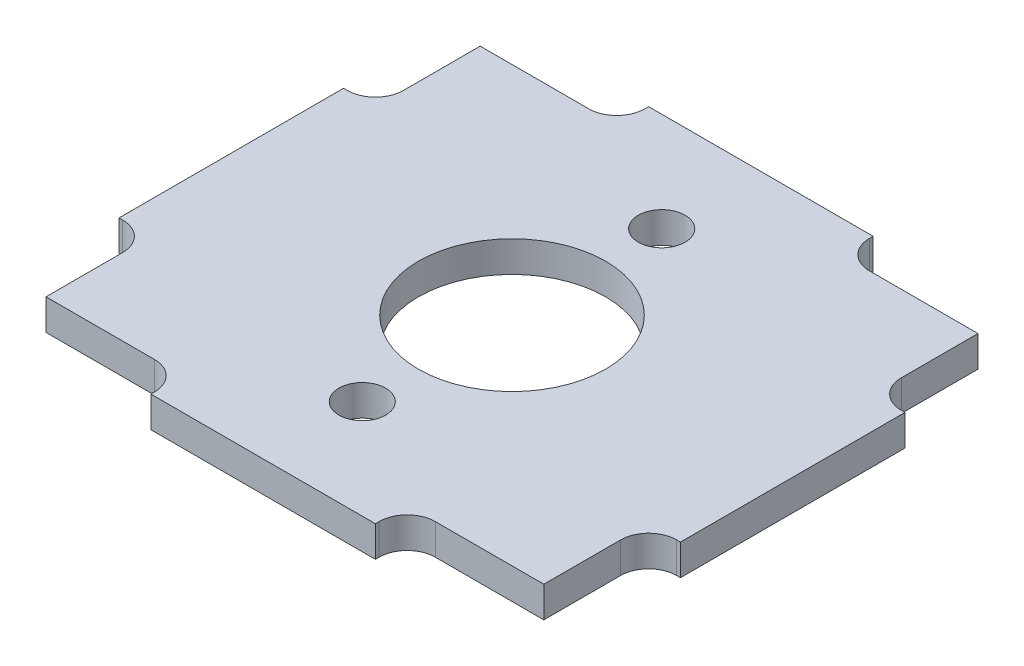
ISO-10303-21;
HEADER;
FILE_DESCRIPTION(('STEP AP214'),'2;1');
FILE_NAME('part.step','',(''),(''),'','','');
FILE_SCHEMA(('AUTOMOTIVE_DESIGN { 1 0 10303 214 1 1 1 1 }'));
ENDSEC;
DATA;
#1=APPLICATION_CONTEXT('core data for automotive mechanical design processes');
#2=APPLICATION_PROTOCOL_DEFINITION('international standard','automotive_design',2000,#1);
#3=PRODUCT_CONTEXT('',#1,'mechanical');
#4=PRODUCT('Part','Part','',(#3));
#5=PRODUCT_RELATED_PRODUCT_CATEGORY('part','',(#4));
#6=PRODUCT_DEFINITION_FORMATION('','',#4);
#7=PRODUCT_DEFINITION_CONTEXT('part definition',#1,'design');
#8=PRODUCT_DEFINITION('design','',#6,#7);
#9=PRODUCT_DEFINITION_SHAPE('','',#8);
#10=(LENGTH_UNIT() NAMED_UNIT(*) SI_UNIT(.MILLI.,.METRE.));
#11=(NAMED_UNIT(*) PLANE_ANGLE_UNIT() SI_UNIT($,.RADIAN.));
#12=(NAMED_UNIT(*) SI_UNIT($,.STERADIAN.) SOLID_ANGLE_UNIT());
#13=UNCERTAINTY_MEASURE_WITH_UNIT(LENGTH_MEASURE(1.E-05),#10,'distance_accuracy_value','');
#14=(GEOMETRIC_REPRESENTATION_CONTEXT(3) GLOBAL_UNCERTAINTY_ASSIGNED_CONTEXT((#13)) GLOBAL_UNIT_ASSIGNED_CONTEXT((#10,
#11,#12)) REPRESENTATION_CONTEXT('',''));
#15=CARTESIAN_POINT('',(0.,0.,0.));
#16=DIRECTION('',(0.,0.,1.));
#17=DIRECTION('',(1.,0.,0.));
#18=AXIS2_PLACEMENT_3D('',#15,#16,#17);
#19=CARTESIAN_POINT('',(-6.,-0.825,0.));
#20=DIRECTION('',(1.,0.,0.));
#21=DIRECTION('',(0.,0.,-1.));
#22=AXIS2_PLACEMENT_3D('',#19,#20,#21);
#23=PLANE('',#22);
#24=DIRECTION('',(0.,0.,-1.));
#25=VECTOR('',#24,1.);
#26=CARTESIAN_POINT('',(-6.,0.825,0.));
#27=LINE('',#26,#25);
#28=CARTESIAN_POINT('',(-6.,0.825,13.3));
#29=VERTEX_POINT('',#28);
#30=CARTESIAN_POINT('',(-6.,0.825,13.1));
#31=VERTEX_POINT('',#30);
#32=EDGE_CURVE('E298',#29,#31,#27,.T.);
#33=ORIENTED_EDGE('',*,*,#32,.T.);
#34=DIRECTION('',(0.,1.,0.));
#35=VECTOR('',#34,1.);
#36=CARTESIAN_POINT('',(-6.,-0.825,13.1));
#37=LINE('',#36,#35);
#38=CARTESIAN_POINT('',(-6.,-0.825,13.1));
#39=VERTEX_POINT('',#38);
#40=EDGE_CURVE('E236',#31,#39,#37,.F.);
#41=ORIENTED_EDGE('',*,*,#40,.T.);
#42=DIRECTION('',(0.,0.,-1.));
#43=VECTOR('',#42,1.);
#44=CARTESIAN_POINT('',(-6.,-0.825,0.));
#45=LINE('',#44,#43);
#46=CARTESIAN_POINT('',(-6.,-0.825,13.3));
#47=VERTEX_POINT('',#46);
#48=EDGE_CURVE('E234',#47,#39,#45,.T.);
#49=ORIENTED_EDGE('',*,*,#48,.F.);
#50=DIRECTION('',(0.,1.,0.));
#51=VECTOR('',#50,1.);
#52=CARTESIAN_POINT('',(-6.,-0.825,13.3));
#53=LINE('',#52,#51);
#54=EDGE_CURVE('E220',#47,#29,#53,.T.);
#55=ORIENTED_EDGE('',*,*,#54,.T.);
#56=EDGE_LOOP('',(#33,#41,#49,#55));
#57=FACE_BOUND('',#56,.T.);
#58=ADVANCED_FACE('F35',(#57),#23,.F.);
#59=CARTESIAN_POINT('',(0.,-0.825,11.6));
#60=DIRECTION('',(0.,0.,-1.));
#61=DIRECTION('',(-1.,0.,0.));
#62=AXIS2_PLACEMENT_3D('',#59,#60,#61);
#63=PLANE('',#62);
#64=DIRECTION('',(-1.,0.,0.));
#65=VECTOR('',#64,1.);
#66=CARTESIAN_POINT('',(0.,-0.825,11.6));
#67=LINE('',#66,#65);
#68=CARTESIAN_POINT('',(-7.5,-0.825,11.6));
#69=VERTEX_POINT('',#68);
#70=CARTESIAN_POINT('',(-13.3,-0.825,11.6));
#71=VERTEX_POINT('',#70);
#72=EDGE_CURVE('E231',#69,#71,#67,.T.);
#73=ORIENTED_EDGE('',*,*,#72,.F.);
#74=DIRECTION('',(0.,1.,0.));
#75=VECTOR('',#74,1.);
#76=CARTESIAN_POINT('',(-7.5,0.825,11.6));
#77=LINE('',#76,#75);
#78=CARTESIAN_POINT('',(-7.5,0.825,11.6));
#79=VERTEX_POINT('',#78);
#80=EDGE_CURVE('E381',#69,#79,#77,.T.);
#81=ORIENTED_EDGE('',*,*,#80,.T.);
#82=DIRECTION('',(-1.,0.,0.));
#83=VECTOR('',#82,1.);
#84=CARTESIAN_POINT('',(0.,0.825,11.6));
#85=LINE('',#84,#83);
#86=CARTESIAN_POINT('',(-13.3,0.825,11.6));
#87=VERTEX_POINT('',#86);
#88=EDGE_CURVE('E342',#79,#87,#85,.T.);
#89=ORIENTED_EDGE('',*,*,#88,.T.);
#90=DIRECTION('',(0.,1.,0.));
#91=VECTOR('',#90,1.);
#92=CARTESIAN_POINT('',(-13.3,-0.825,11.6));
#93=LINE('',#92,#91);
#94=EDGE_CURVE('E346',#71,#87,#93,.T.);
#95=ORIENTED_EDGE('',*,*,#94,.F.);
#96=EDGE_LOOP('',(#73,#81,#89,#95));
#97=FACE_BOUND('',#96,.T.);
#98=ADVANCED_FACE('F499',(#97),#63,.F.);
#99=CARTESIAN_POINT('',(-13.3,-0.825,0.));
#100=DIRECTION('',(-1.,0.,0.));
#101=DIRECTION('',(0.,0.,1.));
#102=AXIS2_PLACEMENT_3D('',#99,#100,#101);
#103=PLANE('',#102);
#104=DIRECTION('',(0.,0.,1.));
#105=VECTOR('',#104,1.);
#106=CARTESIAN_POINT('',(-13.3,0.825,0.));
#107=LINE('',#106,#105);
#108=CARTESIAN_POINT('',(-13.3,0.825,7.5));
#109=VERTEX_POINT('',#108);
#110=EDGE_CURVE('E340',#109,#87,#107,.T.);
#111=ORIENTED_EDGE('',*,*,#110,.F.);
#112=DIRECTION('',(0.,1.,0.));
#113=VECTOR('',#112,1.);
#114=CARTESIAN_POINT('',(-13.3,-0.825,7.5));
#115=LINE('',#114,#113);
#116=CARTESIAN_POINT('',(-13.3,-0.825,7.5));
#117=VERTEX_POINT('',#116);
#118=EDGE_CURVE('E388',#109,#117,#115,.F.);
#119=ORIENTED_EDGE('',*,*,#118,.T.);
#120=DIRECTION('',(0.,0.,1.));
#121=VECTOR('',#120,1.);
#122=CARTESIAN_POINT('',(-13.3,-0.825,0.));
#123=LINE('',#122,#121);
#124=EDGE_CURVE('E285',#117,#71,#123,.T.);
#125=ORIENTED_EDGE('',*,*,#124,.T.);
#126=ORIENTED_EDGE('',*,*,#94,.T.);
#127=EDGE_LOOP('',(#111,#119,#125,#126));
#128=FACE_BOUND('',#127,.T.);
#129=ADVANCED_FACE('F504',(#128),#103,.T.);
#130=CARTESIAN_POINT('',(0.,-0.825,6.));
#131=DIRECTION('',(0.,0.,1.));
#132=DIRECTION('',(1.,0.,0.));
#133=AXIS2_PLACEMENT_3D('',#130,#131,#132);
#134=PLANE('',#133);
#135=DIRECTION('',(1.,0.,0.));
#136=VECTOR('',#135,1.);
#137=CARTESIAN_POINT('',(0.,-0.825,6.));
#138=LINE('',#137,#136);
#139=CARTESIAN_POINT('',(-15.,-0.825,6.));
#140=VERTEX_POINT('',#139);
#141=CARTESIAN_POINT('',(-14.8,-0.825,6.));
#142=VERTEX_POINT('',#141);
#143=EDGE_CURVE('E282',#140,#142,#138,.T.);
#144=ORIENTED_EDGE('',*,*,#143,.T.);
#145=DIRECTION('',(0.,1.,0.));
#146=VECTOR('',#145,1.);
#147=CARTESIAN_POINT('',(-14.8,0.825,6.));
#148=LINE('',#147,#146);
#149=CARTESIAN_POINT('',(-14.8,0.825,6.));
#150=VERTEX_POINT('',#149);
#151=EDGE_CURVE('E385',#142,#150,#148,.T.);
#152=ORIENTED_EDGE('',*,*,#151,.T.);
#153=DIRECTION('',(1.,0.,0.));
#154=VECTOR('',#153,1.);
#155=CARTESIAN_POINT('',(0.,0.825,6.));
#156=LINE('',#155,#154);
#157=CARTESIAN_POINT('',(-15.,0.825,6.));
#158=VERTEX_POINT('',#157);
#159=EDGE_CURVE('E337',#158,#150,#156,.T.);
#160=ORIENTED_EDGE('',*,*,#159,.F.);
#161=DIRECTION('',(0.,1.,0.));
#162=VECTOR('',#161,1.);
#163=CARTESIAN_POINT('',(-15.,-0.825,6.));
#164=LINE('',#163,#162);
#165=EDGE_CURVE('E350',#140,#158,#164,.T.);
#166=ORIENTED_EDGE('',*,*,#165,.F.);
#167=EDGE_LOOP('',(#144,#152,#160,#166));
#168=FACE_BOUND('',#167,.T.);
#169=ADVANCED_FACE('F720',(#168),#134,.T.);
#170=CARTESIAN_POINT('',(-15.,-0.825,0.));
#171=DIRECTION('',(-1.,0.,0.));
#172=DIRECTION('',(0.,0.,1.));
#173=AXIS2_PLACEMENT_3D('',#170,#171,#172);
#174=PLANE('',#173);
#175=DIRECTION('',(0.,0.,1.));
#176=VECTOR('',#175,1.);
#177=CARTESIAN_POINT('',(-15.,0.825,0.));
#178=LINE('',#177,#176);
#179=CARTESIAN_POINT('',(-15.,0.825,-6.));
#180=VERTEX_POINT('',#179);
#181=EDGE_CURVE('E334',#180,#158,#178,.T.);
#182=ORIENTED_EDGE('',*,*,#181,.F.);
#183=DIRECTION('',(0.,1.,0.));
#184=VECTOR('',#183,1.);
#185=CARTESIAN_POINT('',(-15.,-0.825,-6.));
#186=LINE('',#185,#184);
#187=CARTESIAN_POINT('',(-15.,-0.825,-6.));
#188=VERTEX_POINT('',#187);
#189=EDGE_CURVE('E352',#188,#180,#186,.T.);
#190=ORIENTED_EDGE('',*,*,#189,.F.);
#191=DIRECTION('',(0.,0.,1.));
#192=VECTOR('',#191,1.);
#193=CARTESIAN_POINT('',(-15.,-0.825,0.));
#194=LINE('',#193,#192);
#195=EDGE_CURVE('E279',#188,#140,#194,.T.);
#196=ORIENTED_EDGE('',*,*,#195,.T.);
#197=ORIENTED_EDGE('',*,*,#165,.T.);
#198=EDGE_LOOP('',(#182,#190,#196,#197));
#199=FACE_BOUND('',#198,.T.);
#200=ADVANCED_FACE('F712',(#199),#174,.T.);
#201=CARTESIAN_POINT('',(0.,-0.825,-6.));
#202=DIRECTION('',(0.,0.,-1.));
#203=DIRECTION('',(-1.,0.,0.));
#204=AXIS2_PLACEMENT_3D('',#201,#202,#203);
#205=PLANE('',#204);
#206=DIRECTION('',(-1.,0.,0.));
#207=VECTOR('',#206,1.);
#208=CARTESIAN_POINT('',(0.,0.825,-6.));
#209=LINE('',#208,#207);
#210=CARTESIAN_POINT('',(-14.8,0.825,-6.));
#211=VERTEX_POINT('',#210);
#212=EDGE_CURVE('E332',#211,#180,#209,.T.);
#213=ORIENTED_EDGE('',*,*,#212,.F.);
#214=DIRECTION('',(0.,1.,0.));
#215=VECTOR('',#214,1.);
#216=CARTESIAN_POINT('',(-14.8,-0.825,-6.));
#217=LINE('',#216,#215);
#218=CARTESIAN_POINT('',(-14.8,-0.825,-6.));
#219=VERTEX_POINT('',#218);
#220=EDGE_CURVE('E393',#211,#219,#217,.F.);
#221=ORIENTED_EDGE('',*,*,#220,.T.);
#222=DIRECTION('',(-1.,0.,0.));
#223=VECTOR('',#222,1.);
#224=CARTESIAN_POINT('',(0.,-0.825,-6.));
#225=LINE('',#224,#223);
#226=EDGE_CURVE('E277',#219,#188,#225,.T.);
#227=ORIENTED_EDGE('',*,*,#226,.T.);
#228=ORIENTED_EDGE('',*,*,#189,.T.);
#229=EDGE_LOOP('',(#213,#221,#227,#228));
#230=FACE_BOUND('',#229,.T.);
#231=ADVANCED_FACE('F702',(#230),#205,.T.);
#232=CARTESIAN_POINT('',(-13.3,-0.825,0.));
#233=DIRECTION('',(-1.,0.,0.));
#234=DIRECTION('',(0.,0.,1.));
#235=AXIS2_PLACEMENT_3D('',#232,#233,#234);
#236=PLANE('',#235);
#237=DIRECTION('',(0.,0.,1.));
#238=VECTOR('',#237,1.);
#239=CARTESIAN_POINT('',(-13.3,-0.825,0.));
#240=LINE('',#239,#238);
#241=CARTESIAN_POINT('',(-13.3,-0.825,-11.6));
#242=VERTEX_POINT('',#241);
#243=CARTESIAN_POINT('',(-13.3,-0.825,-7.5));
#244=VERTEX_POINT('',#243);
#245=EDGE_CURVE('E274',#242,#244,#240,.T.);
#246=ORIENTED_EDGE('',*,*,#245,.T.);
#247=DIRECTION('',(0.,1.,0.));
#248=VECTOR('',#247,1.);
#249=CARTESIAN_POINT('',(-13.3,0.825,-7.5));
#250=LINE('',#249,#248);
#251=CARTESIAN_POINT('',(-13.3,0.825,-7.5));
#252=VERTEX_POINT('',#251);
#253=EDGE_CURVE('E390',#244,#252,#250,.T.);
#254=ORIENTED_EDGE('',*,*,#253,.T.);
#255=DIRECTION('',(0.,0.,1.));
#256=VECTOR('',#255,1.);
#257=CARTESIAN_POINT('',(-13.3,0.825,0.));
#258=LINE('',#257,#256);
#259=CARTESIAN_POINT('',(-13.3,0.825,-11.6));
#260=VERTEX_POINT('',#259);
#261=EDGE_CURVE('E329',#260,#252,#258,.T.);
#262=ORIENTED_EDGE('',*,*,#261,.F.);
#263=DIRECTION('',(0.,1.,0.));
#264=VECTOR('',#263,1.);
#265=CARTESIAN_POINT('',(-13.3,-0.825,-11.6));
#266=LINE('',#265,#264);
#267=EDGE_CURVE('E355',#242,#260,#266,.T.);
#268=ORIENTED_EDGE('',*,*,#267,.F.);
#269=EDGE_LOOP('',(#246,#254,#262,#268));
#270=FACE_BOUND('',#269,.T.);
#271=ADVANCED_FACE('F692',(#270),#236,.T.);
#272=CARTESIAN_POINT('',(0.,-0.825,-11.6));
#273=DIRECTION('',(0.,0.,-1.));
#274=DIRECTION('',(-1.,0.,0.));
#275=AXIS2_PLACEMENT_3D('',#272,#273,#274);
#276=PLANE('',#275);
#277=DIRECTION('',(-1.,0.,0.));
#278=VECTOR('',#277,1.);
#279=CARTESIAN_POINT('',(0.,0.825,-11.6));
#280=LINE('',#279,#278);
#281=CARTESIAN_POINT('',(-7.50000000000001,0.825,-11.6));
#282=VERTEX_POINT('',#281);
#283=EDGE_CURVE('E327',#282,#260,#280,.T.);
#284=ORIENTED_EDGE('',*,*,#283,.F.);
#285=DIRECTION('',(0.,1.,0.));
#286=VECTOR('',#285,1.);
#287=CARTESIAN_POINT('',(-7.50000000000001,-0.825,-11.6));
#288=LINE('',#287,#286);
#289=CARTESIAN_POINT('',(-7.50000000000001,-0.825,-11.6));
#290=VERTEX_POINT('',#289);
#291=EDGE_CURVE('E398',#282,#290,#288,.F.);
#292=ORIENTED_EDGE('',*,*,#291,.T.);
#293=DIRECTION('',(-1.,0.,0.));
#294=VECTOR('',#293,1.);
#295=CARTESIAN_POINT('',(0.,-0.825,-11.6));
#296=LINE('',#295,#294);
#297=EDGE_CURVE('E272',#290,#242,#296,.T.);
#298=ORIENTED_EDGE('',*,*,#297,.T.);
#299=ORIENTED_EDGE('',*,*,#267,.T.);
#300=EDGE_LOOP('',(#284,#292,#298,#299));
#301=FACE_BOUND('',#300,.T.);
#302=ADVANCED_FACE('F682',(#301),#276,.T.);
#303=CARTESIAN_POINT('',(-6.,-0.825,0.));
#304=DIRECTION('',(1.,0.,0.));
#305=DIRECTION('',(0.,0.,-1.));
#306=AXIS2_PLACEMENT_3D('',#303,#304,#305);
#307=PLANE('',#306);
#308=DIRECTION('',(0.,0.,-1.));
#309=VECTOR('',#308,1.);
#310=CARTESIAN_POINT('',(-6.,-0.825,0.));
#311=LINE('',#310,#309);
#312=CARTESIAN_POINT('',(-6.,-0.825,-13.1));
#313=VERTEX_POINT('',#312);
#314=CARTESIAN_POINT('',(-6.,-0.825,-13.3));
#315=VERTEX_POINT('',#314);
#316=EDGE_CURVE('E270',#313,#315,#311,.T.);
#317=ORIENTED_EDGE('',*,*,#316,.F.);
#318=DIRECTION('',(0.,1.,0.));
#319=VECTOR('',#318,1.);
#320=CARTESIAN_POINT('',(-6.,-0.825,-13.1));
#321=LINE('',#320,#319);
#322=CARTESIAN_POINT('',(-6.,0.825,-13.1));
#323=VERTEX_POINT('',#322);
#324=EDGE_CURVE('E395',#313,#323,#321,.T.);
#325=ORIENTED_EDGE('',*,*,#324,.T.);
#326=DIRECTION('',(0.,0.,-1.));
#327=VECTOR('',#326,1.);
#328=CARTESIAN_POINT('',(-6.,0.825,0.));
#329=LINE('',#328,#327);
#330=CARTESIAN_POINT('',(-6.,0.825,-13.3));
#331=VERTEX_POINT('',#330);
#332=EDGE_CURVE('E325',#323,#331,#329,.T.);
#333=ORIENTED_EDGE('',*,*,#332,.T.);
#334=DIRECTION('',(0.,1.,0.));
#335=VECTOR('',#334,1.);
#336=CARTESIAN_POINT('',(-6.,-0.825,-13.3));
#337=LINE('',#336,#335);
#338=EDGE_CURVE('E358',#315,#331,#337,.T.);
#339=ORIENTED_EDGE('',*,*,#338,.F.);
#340=EDGE_LOOP('',(#317,#325,#333,#339));
#341=FACE_BOUND('',#340,.T.);
#342=ADVANCED_FACE('F677',(#341),#307,.F.);
#343=CARTESIAN_POINT('',(0.,-0.825,-13.3));
#344=DIRECTION('',(0.,0.,1.));
#345=DIRECTION('',(1.,0.,0.));
#346=AXIS2_PLACEMENT_3D('',#343,#344,#345);
#347=PLANE('',#346);
#348=DIRECTION('',(1.,0.,0.));
#349=VECTOR('',#348,1.);
#350=CARTESIAN_POINT('',(0.,0.825,-13.3));
#351=LINE('',#350,#349);
#352=CARTESIAN_POINT('',(6.,0.825,-13.3));
#353=VERTEX_POINT('',#352);
#354=EDGE_CURVE('E323',#331,#353,#351,.T.);
#355=ORIENTED_EDGE('',*,*,#354,.T.);
#356=DIRECTION('',(0.,1.,0.));
#357=VECTOR('',#356,1.);
#358=CARTESIAN_POINT('',(6.,-0.825,-13.3));
#359=LINE('',#358,#357);
#360=CARTESIAN_POINT('',(6.,-0.825,-13.3));
#361=VERTEX_POINT('',#360);
#362=EDGE_CURVE('E361',#361,#353,#359,.T.);
#363=ORIENTED_EDGE('',*,*,#362,.F.);
#364=DIRECTION('',(1.,0.,0.));
#365=VECTOR('',#364,1.);
#366=CARTESIAN_POINT('',(0.,-0.825,-13.3));
#367=LINE('',#366,#365);
#368=EDGE_CURVE('E268',#315,#361,#367,.T.);
#369=ORIENTED_EDGE('',*,*,#368,.F.);
#370=ORIENTED_EDGE('',*,*,#338,.T.);
#371=EDGE_LOOP('',(#355,#363,#369,#370));
#372=FACE_BOUND('',#371,.T.);
#373=ADVANCED_FACE('F670',(#372),#347,.F.);
#374=CARTESIAN_POINT('',(6.00000000000006,-0.825,0.));
#375=DIRECTION('',(-1.,0.,0.));
#376=DIRECTION('',(0.,0.,1.));
#377=AXIS2_PLACEMENT_3D('',#374,#375,#376);
#378=PLANE('',#377);
#379=DIRECTION('',(0.,0.,1.));
#380=VECTOR('',#379,1.);
#381=CARTESIAN_POINT('',(6.00000000000006,0.825,0.));
#382=LINE('',#381,#380);
#383=CARTESIAN_POINT('',(6.,0.825,-13.1));
#384=VERTEX_POINT('',#383);
#385=EDGE_CURVE('E321',#353,#384,#382,.T.);
#386=ORIENTED_EDGE('',*,*,#385,.T.);
#387=DIRECTION('',(0.,1.,0.));
#388=VECTOR('',#387,1.);
#389=CARTESIAN_POINT('',(6.,-0.825,-13.1));
#390=LINE('',#389,#388);
#391=CARTESIAN_POINT('',(6.,-0.825,-13.1));
#392=VERTEX_POINT('',#391);
#393=EDGE_CURVE('E50',#384,#392,#390,.F.);
#394=ORIENTED_EDGE('',*,*,#393,.T.);
#395=DIRECTION('',(0.,0.,1.));
#396=VECTOR('',#395,1.);
#397=CARTESIAN_POINT('',(6.00000000000006,-0.825,0.));
#398=LINE('',#397,#396);
#399=EDGE_CURVE('E266',#361,#392,#398,.T.);
#400=ORIENTED_EDGE('',*,*,#399,.F.);
#401=ORIENTED_EDGE('',*,*,#362,.T.);
#402=EDGE_LOOP('',(#386,#394,#400,#401));
#403=FACE_BOUND('',#402,.T.);
#404=ADVANCED_FACE('F661',(#403),#378,.F.);
#405=CARTESIAN_POINT('',(0.,-0.825,-11.6));
#406=DIRECTION('',(0.,0.,1.));
#407=DIRECTION('',(1.,0.,0.));
#408=AXIS2_PLACEMENT_3D('',#405,#406,#407);
#409=PLANE('',#408);
#410=DIRECTION('',(1.,0.,0.));
#411=VECTOR('',#410,1.);
#412=CARTESIAN_POINT('',(0.,-0.825,-11.6));
#413=LINE('',#412,#411);
#414=CARTESIAN_POINT('',(7.5,-0.825,-11.6));
#415=VERTEX_POINT('',#414);
#416=CARTESIAN_POINT('',(13.3,-0.825,-11.6));
#417=VERTEX_POINT('',#416);
#418=EDGE_CURVE('E264',#415,#417,#413,.T.);
#419=ORIENTED_EDGE('',*,*,#418,.F.);
#420=DIRECTION('',(0.,1.,0.));
#421=VECTOR('',#420,1.);
#422=CARTESIAN_POINT('',(7.5,0.825,-11.6));
#423=LINE('',#422,#421);
#424=CARTESIAN_POINT('',(7.5,0.825,-11.6));
#425=VERTEX_POINT('',#424);
#426=EDGE_CURVE('E410',#415,#425,#423,.T.);
#427=ORIENTED_EDGE('',*,*,#426,.T.);
#428=DIRECTION('',(1.,0.,0.));
#429=VECTOR('',#428,1.);
#430=CARTESIAN_POINT('',(0.,0.825,-11.6));
#431=LINE('',#430,#429);
#432=CARTESIAN_POINT('',(13.3,0.825,-11.6));
#433=VERTEX_POINT('',#432);
#434=EDGE_CURVE('E319',#425,#433,#431,.T.);
#435=ORIENTED_EDGE('',*,*,#434,.T.);
#436=DIRECTION('',(0.,1.,0.));
#437=VECTOR('',#436,1.);
#438=CARTESIAN_POINT('',(13.3,-0.825,-11.6));
#439=LINE('',#438,#437);
#440=EDGE_CURVE('E364',#417,#433,#439,.T.);
#441=ORIENTED_EDGE('',*,*,#440,.F.);
#442=EDGE_LOOP('',(#419,#427,#435,#441));
#443=FACE_BOUND('',#442,.T.);
#444=ADVANCED_FACE('F492',(#443),#409,.F.);
#445=CARTESIAN_POINT('',(13.3,-0.825,0.));
#446=DIRECTION('',(-1.,0.,0.));
#447=DIRECTION('',(0.,0.,1.));
#448=AXIS2_PLACEMENT_3D('',#445,#446,#447);
#449=PLANE('',#448);
#450=DIRECTION('',(0.,0.,1.));
#451=VECTOR('',#450,1.);
#452=CARTESIAN_POINT('',(13.3,0.825,0.));
#453=LINE('',#452,#451);
#454=CARTESIAN_POINT('',(13.3,0.825,-7.5));
#455=VERTEX_POINT('',#454);
#456=EDGE_CURVE('E316',#433,#455,#453,.T.);
#457=ORIENTED_EDGE('',*,*,#456,.T.);
#458=DIRECTION('',(0.,1.,0.));
#459=VECTOR('',#458,1.);
#460=CARTESIAN_POINT('',(13.3,-0.825,-7.5));
#461=LINE('',#460,#459);
#462=CARTESIAN_POINT('',(13.3,-0.825,-7.5));
#463=VERTEX_POINT('',#462);
#464=EDGE_CURVE('E403',#455,#463,#461,.F.);
#465=ORIENTED_EDGE('',*,*,#464,.T.);
#466=DIRECTION('',(0.,0.,1.));
#467=VECTOR('',#466,1.);
#468=CARTESIAN_POINT('',(13.3,-0.825,0.));
#469=LINE('',#468,#467);
#470=EDGE_CURVE('E261',#417,#463,#469,.T.);
#471=ORIENTED_EDGE('',*,*,#470,.F.);
#472=ORIENTED_EDGE('',*,*,#440,.T.);
#473=EDGE_LOOP('',(#457,#465,#471,#472));
#474=FACE_BOUND('',#473,.T.);
#475=ADVANCED_FACE('F486',(#474),#449,.F.);
#476=CARTESIAN_POINT('',(0.,-0.825,-6.));
#477=DIRECTION('',(0.,0.,1.));
#478=DIRECTION('',(1.,0.,0.));
#479=AXIS2_PLACEMENT_3D('',#476,#477,#478);
#480=PLANE('',#479);
#481=DIRECTION('',(1.,0.,0.));
#482=VECTOR('',#481,1.);
#483=CARTESIAN_POINT('',(0.,-0.825,-6.));
#484=LINE('',#483,#482);
#485=CARTESIAN_POINT('',(14.8,-0.825,-6.));
#486=VERTEX_POINT('',#485);
#487=CARTESIAN_POINT('',(15.,-0.825,-6.));
#488=VERTEX_POINT('',#487);
#489=EDGE_CURVE('E259',#486,#488,#484,.T.);
#490=ORIENTED_EDGE('',*,*,#489,.F.);
#491=DIRECTION('',(0.,1.,0.));
#492=VECTOR('',#491,1.);
#493=CARTESIAN_POINT('',(14.8,0.825,-6.));
#494=LINE('',#493,#492);
#495=CARTESIAN_POINT('',(14.8,0.825,-6.));
#496=VERTEX_POINT('',#495);
#497=EDGE_CURVE('E400',#486,#496,#494,.T.);
#498=ORIENTED_EDGE('',*,*,#497,.T.);
#499=DIRECTION('',(1.,0.,0.));
#500=VECTOR('',#499,1.);
#501=CARTESIAN_POINT('',(0.,0.825,-6.));
#502=LINE('',#501,#500);
#503=CARTESIAN_POINT('',(15.,0.825,-6.));
#504=VERTEX_POINT('',#503);
#505=EDGE_CURVE('E314',#496,#504,#502,.T.);
#506=ORIENTED_EDGE('',*,*,#505,.T.);
#507=DIRECTION('',(0.,1.,0.));
#508=VECTOR('',#507,1.);
#509=CARTESIAN_POINT('',(15.,-0.825,-6.));
#510=LINE('',#509,#508);
#511=EDGE_CURVE('E367',#488,#504,#510,.T.);
#512=ORIENTED_EDGE('',*,*,#511,.F.);
#513=EDGE_LOOP('',(#490,#498,#506,#512));
#514=FACE_BOUND('',#513,.T.);
#515=ADVANCED_FACE('F478',(#514),#480,.F.);
#516=CARTESIAN_POINT('',(15.,-0.825,0.));
#517=DIRECTION('',(-1.,0.,0.));
#518=DIRECTION('',(0.,0.,1.));
#519=AXIS2_PLACEMENT_3D('',#516,#517,#518);
#520=PLANE('',#519);
#521=DIRECTION('',(0.,0.,1.));
#522=VECTOR('',#521,1.);
#523=CARTESIAN_POINT('',(15.,0.825,0.));
#524=LINE('',#523,#522);
#525=CARTESIAN_POINT('',(15.,0.825,6.));
#526=VERTEX_POINT('',#525);
#527=EDGE_CURVE('E312',#504,#526,#524,.T.);
#528=ORIENTED_EDGE('',*,*,#527,.T.);
#529=DIRECTION('',(0.,1.,0.));
#530=VECTOR('',#529,1.);
#531=CARTESIAN_POINT('',(15.,-0.825,6.));
#532=LINE('',#531,#530);
#533=CARTESIAN_POINT('',(15.,-0.825,6.));
#534=VERTEX_POINT('',#533);
#535=EDGE_CURVE('E370',#534,#526,#532,.T.);
#536=ORIENTED_EDGE('',*,*,#535,.F.);
#537=DIRECTION('',(0.,0.,1.));
#538=VECTOR('',#537,1.);
#539=CARTESIAN_POINT('',(15.,-0.825,0.));
#540=LINE('',#539,#538);
#541=EDGE_CURVE('E257',#488,#534,#540,.T.);
#542=ORIENTED_EDGE('',*,*,#541,.F.);
#543=ORIENTED_EDGE('',*,*,#511,.T.);
#544=EDGE_LOOP('',(#528,#536,#542,#543));
#545=FACE_BOUND('',#544,.T.);
#546=ADVANCED_FACE('F474',(#545),#520,.F.);
#547=CARTESIAN_POINT('',(0.,-0.825,6.));
#548=DIRECTION('',(0.,0.,-1.));
#549=DIRECTION('',(-1.,0.,0.));
#550=AXIS2_PLACEMENT_3D('',#547,#548,#549);
#551=PLANE('',#550);
#552=DIRECTION('',(-1.,0.,0.));
#553=VECTOR('',#552,1.);
#554=CARTESIAN_POINT('',(0.,0.825,6.));
#555=LINE('',#554,#553);
#556=CARTESIAN_POINT('',(14.8,0.825,6.));
#557=VERTEX_POINT('',#556);
#558=EDGE_CURVE('E309',#526,#557,#555,.T.);
#559=ORIENTED_EDGE('',*,*,#558,.T.);
#560=DIRECTION('',(0.,1.,0.));
#561=VECTOR('',#560,1.);
#562=CARTESIAN_POINT('',(14.8,-0.825,6.));
#563=LINE('',#562,#561);
#564=CARTESIAN_POINT('',(14.8,-0.825,6.));
#565=VERTEX_POINT('',#564);
#566=EDGE_CURVE('E379',#557,#565,#563,.F.);
#567=ORIENTED_EDGE('',*,*,#566,.T.);
#568=DIRECTION('',(-1.,0.,0.));
#569=VECTOR('',#568,1.);
#570=CARTESIAN_POINT('',(0.,-0.825,6.));
#571=LINE('',#570,#569);
#572=EDGE_CURVE('E254',#534,#565,#571,.T.);
#573=ORIENTED_EDGE('',*,*,#572,.F.);
#574=ORIENTED_EDGE('',*,*,#535,.T.);
#575=EDGE_LOOP('',(#559,#567,#573,#574));
#576=FACE_BOUND('',#575,.T.);
#577=ADVANCED_FACE('F465',(#576),#551,.F.);
#578=CARTESIAN_POINT('',(13.3,-0.825,0.));
#579=DIRECTION('',(-1.,0.,0.));
#580=DIRECTION('',(0.,0.,1.));
#581=AXIS2_PLACEMENT_3D('',#578,#579,#580);
#582=PLANE('',#581);
#583=DIRECTION('',(0.,0.,1.));
#584=VECTOR('',#583,1.);
#585=CARTESIAN_POINT('',(13.3,-0.825,0.));
#586=LINE('',#585,#584);
#587=CARTESIAN_POINT('',(13.3,-0.825,7.5));
#588=VERTEX_POINT('',#587);
#589=CARTESIAN_POINT('',(13.3,-0.825,11.6));
#590=VERTEX_POINT('',#589);
#591=EDGE_CURVE('E251',#588,#590,#586,.T.);
#592=ORIENTED_EDGE('',*,*,#591,.F.);
#593=DIRECTION('',(0.,1.,0.));
#594=VECTOR('',#593,1.);
#595=CARTESIAN_POINT('',(13.3,0.825,7.5));
#596=LINE('',#595,#594);
#597=CARTESIAN_POINT('',(13.3,0.825,7.5));
#598=VERTEX_POINT('',#597);
#599=EDGE_CURVE('E349',#588,#598,#596,.T.);
#600=ORIENTED_EDGE('',*,*,#599,.T.);
#601=DIRECTION('',(0.,0.,1.));
#602=VECTOR('',#601,1.);
#603=CARTESIAN_POINT('',(13.3,0.825,0.));
#604=LINE('',#603,#602);
#605=CARTESIAN_POINT('',(13.3,0.825,11.6));
#606=VERTEX_POINT('',#605);
#607=EDGE_CURVE('E306',#598,#606,#604,.T.);
#608=ORIENTED_EDGE('',*,*,#607,.T.);
#609=DIRECTION('',(0.,1.,0.));
#610=VECTOR('',#609,1.);
#611=CARTESIAN_POINT('',(13.3,-0.825,11.6));
#612=LINE('',#611,#610);
#613=EDGE_CURVE('E373',#590,#606,#612,.T.);
#614=ORIENTED_EDGE('',*,*,#613,.F.);
#615=EDGE_LOOP('',(#592,#600,#608,#614));
#616=FACE_BOUND('',#615,.T.);
#617=ADVANCED_FACE('F458',(#616),#582,.F.);
#618=CARTESIAN_POINT('',(0.,-0.825,11.6));
#619=DIRECTION('',(0.,0.,1.));
#620=DIRECTION('',(1.,0.,0.));
#621=AXIS2_PLACEMENT_3D('',#618,#619,#620);
#622=PLANE('',#621);
#623=DIRECTION('',(1.,0.,0.));
#624=VECTOR('',#623,1.);
#625=CARTESIAN_POINT('',(0.,0.825,11.6));
#626=LINE('',#625,#624);
#627=CARTESIAN_POINT('',(7.5,0.825,11.6));
#628=VERTEX_POINT('',#627);
#629=EDGE_CURVE('E304',#628,#606,#626,.T.);
#630=ORIENTED_EDGE('',*,*,#629,.F.);
#631=DIRECTION('',(0.,1.,0.));
#632=VECTOR('',#631,1.);
#633=CARTESIAN_POINT('',(7.5,-0.825,11.6));
#634=LINE('',#633,#632);
#635=CARTESIAN_POINT('',(7.5,-0.825,11.6));
#636=VERTEX_POINT('',#635);
#637=EDGE_CURVE('E408',#628,#636,#634,.F.);
#638=ORIENTED_EDGE('',*,*,#637,.T.);
#639=DIRECTION('',(1.,0.,0.));
#640=VECTOR('',#639,1.);
#641=CARTESIAN_POINT('',(0.,-0.825,11.6));
#642=LINE('',#641,#640);
#643=EDGE_CURVE('E246',#636,#590,#642,.T.);
#644=ORIENTED_EDGE('',*,*,#643,.T.);
#645=ORIENTED_EDGE('',*,*,#613,.T.);
#646=EDGE_LOOP('',(#630,#638,#644,#645));
#647=FACE_BOUND('',#646,.T.);
#648=ADVANCED_FACE('F454',(#647),#622,.T.);
#649=CARTESIAN_POINT('',(6.00000000000001,-0.825,0.));
#650=DIRECTION('',(1.,0.,0.));
#651=DIRECTION('',(0.,0.,-1.));
#652=AXIS2_PLACEMENT_3D('',#649,#650,#651);
#653=PLANE('',#652);
#654=DIRECTION('',(0.,0.,-1.));
#655=VECTOR('',#654,1.);
#656=CARTESIAN_POINT('',(6.00000000000001,-0.825,0.));
#657=LINE('',#656,#655);
#658=CARTESIAN_POINT('',(6.,-0.825,13.3));
#659=VERTEX_POINT('',#658);
#660=CARTESIAN_POINT('',(6.,-0.825,13.1));
#661=VERTEX_POINT('',#660);
#662=EDGE_CURVE('E244',#659,#661,#657,.T.);
#663=ORIENTED_EDGE('',*,*,#662,.T.);
#664=DIRECTION('',(0.,1.,0.));
#665=VECTOR('',#664,1.);
#666=CARTESIAN_POINT('',(6.,0.825,13.1));
#667=LINE('',#666,#665);
#668=CARTESIAN_POINT('',(6.,0.825,13.1));
#669=VERTEX_POINT('',#668);
#670=EDGE_CURVE('E405',#661,#669,#667,.T.);
#671=ORIENTED_EDGE('',*,*,#670,.T.);
#672=DIRECTION('',(0.,0.,-1.));
#673=VECTOR('',#672,1.);
#674=CARTESIAN_POINT('',(6.00000000000001,0.825,0.));
#675=LINE('',#674,#673);
#676=CARTESIAN_POINT('',(6.,0.825,13.3));
#677=VERTEX_POINT('',#676);
#678=EDGE_CURVE('E301',#677,#669,#675,.T.);
#679=ORIENTED_EDGE('',*,*,#678,.F.);
#680=DIRECTION('',(0.,1.,0.));
#681=VECTOR('',#680,1.);
#682=CARTESIAN_POINT('',(6.,-0.825,13.3));
#683=LINE('',#682,#681);
#684=EDGE_CURVE('E230',#659,#677,#683,.T.);
#685=ORIENTED_EDGE('',*,*,#684,.F.);
#686=EDGE_LOOP('',(#663,#671,#679,#685));
#687=FACE_BOUND('',#686,.T.);
#688=ADVANCED_FACE('F447',(#687),#653,.T.);
#689=CARTESIAN_POINT('',(0.,-0.825,8.));
#690=DIRECTION('',(0.,1.,0.));
#691=DIRECTION('',(0.,0.,1.));
#692=AXIS2_PLACEMENT_3D('',#689,#690,#691);
#693=CYLINDRICAL_SURFACE('',#692,1.25);
#694=CARTESIAN_POINT('',(0.,-0.825,8.));
#695=DIRECTION('',(0.,1.,0.));
#696=DIRECTION('',(0.,0.,1.));
#697=AXIS2_PLACEMENT_3D('',#694,#695,#696);
#698=CIRCLE('',#697,1.25);
#699=CARTESIAN_POINT('',(0.,-0.825,9.25));
#700=VERTEX_POINT('',#699);
#701=EDGE_CURVE('E239',#700,#700,#698,.T.);
#702=ORIENTED_EDGE('',*,*,#701,.F.);
#703=EDGE_LOOP('',(#702));
#704=FACE_BOUND('',#703,.T.);
#705=CARTESIAN_POINT('',(0.,0.825,8.));
#706=DIRECTION('',(0.,1.,0.));
#707=DIRECTION('',(0.,0.,1.));
#708=AXIS2_PLACEMENT_3D('',#705,#706,#707);
#709=CIRCLE('',#708,1.25);
#710=CARTESIAN_POINT('',(0.,0.825,9.25));
#711=VERTEX_POINT('',#710);
#712=EDGE_CURVE('E295',#711,#711,#709,.T.);
#713=ORIENTED_EDGE('',*,*,#712,.T.);
#714=EDGE_LOOP('',(#713));
#715=FACE_BOUND('',#714,.T.);
#716=ADVANCED_FACE('F510',(#704,#715),#693,.F.);
#717=CARTESIAN_POINT('',(0.,-0.825,-8.));
#718=DIRECTION('',(0.,1.,0.));
#719=DIRECTION('',(0.,0.,1.));
#720=AXIS2_PLACEMENT_3D('',#717,#718,#719);
#721=CYLINDRICAL_SURFACE('',#720,1.25);
#722=CARTESIAN_POINT('',(0.,-0.825,-8.));
#723=DIRECTION('',(0.,1.,0.));
#724=DIRECTION('',(0.,0.,1.));
#725=AXIS2_PLACEMENT_3D('',#722,#723,#724);
#726=CIRCLE('',#725,1.25);
#727=CARTESIAN_POINT('',(0.,-0.825,-6.75));
#728=VERTEX_POINT('',#727);
#729=EDGE_CURVE('E835',#728,#728,#726,.T.);
#730=ORIENTED_EDGE('',*,*,#729,.F.);
#731=EDGE_LOOP('',(#730));
#732=FACE_BOUND('',#731,.T.);
#733=CARTESIAN_POINT('',(0.,0.825,-8.));
#734=DIRECTION('',(0.,1.,0.));
#735=DIRECTION('',(0.,0.,1.));
#736=AXIS2_PLACEMENT_3D('',#733,#734,#735);
#737=CIRCLE('',#736,1.25);
#738=CARTESIAN_POINT('',(0.,0.825,-6.75));
#739=VERTEX_POINT('',#738);
#740=EDGE_CURVE('E292',#739,#739,#737,.T.);
#741=ORIENTED_EDGE('',*,*,#740,.T.);
#742=EDGE_LOOP('',(#741));
#743=FACE_BOUND('',#742,.T.);
#744=ADVANCED_FACE('F513',(#732,#743),#721,.F.);
#745=CARTESIAN_POINT('',(0.,-0.825,0.));
#746=DIRECTION('',(0.,1.,0.));
#747=DIRECTION('',(0.,0.,1.));
#748=AXIS2_PLACEMENT_3D('',#745,#746,#747);
#749=CYLINDRICAL_SURFACE('',#748,5.);
#750=CARTESIAN_POINT('',(0.,-0.825,0.));
#751=DIRECTION('',(0.,1.,0.));
#752=DIRECTION('',(0.,0.,1.));
#753=AXIS2_PLACEMENT_3D('',#750,#751,#752);
#754=CIRCLE('',#753,5.);
#755=CARTESIAN_POINT('',(0.,-0.825,5.));
#756=VERTEX_POINT('',#755);
#757=EDGE_CURVE('E345',#756,#756,#754,.T.);
#758=ORIENTED_EDGE('',*,*,#757,.F.);
#759=EDGE_LOOP('',(#758));
#760=FACE_BOUND('',#759,.T.);
#761=CARTESIAN_POINT('',(0.,0.825,0.));
#762=DIRECTION('',(0.,1.,0.));
#763=DIRECTION('',(0.,0.,1.));
#764=AXIS2_PLACEMENT_3D('',#761,#762,#763);
#765=CIRCLE('',#764,5.);
#766=CARTESIAN_POINT('',(0.,0.825,5.));
#767=VERTEX_POINT('',#766);
#768=EDGE_CURVE('E289',#767,#767,#765,.T.);
#769=ORIENTED_EDGE('',*,*,#768,.T.);
#770=EDGE_LOOP('',(#769));
#771=FACE_BOUND('',#770,.T.);
#772=ADVANCED_FACE('F517',(#760,#771),#749,.F.);
#773=CARTESIAN_POINT('',(0.,-0.825,13.3));
#774=DIRECTION('',(0.,0.,1.));
#775=DIRECTION('',(1.,0.,0.));
#776=AXIS2_PLACEMENT_3D('',#773,#774,#775);
#777=PLANE('',#776);
#778=DIRECTION('',(1.,0.,0.));
#779=VECTOR('',#778,1.);
#780=CARTESIAN_POINT('',(0.,0.825,13.3));
#781=LINE('',#780,#779);
#782=EDGE_CURVE('E226',#29,#677,#781,.T.);
#783=ORIENTED_EDGE('',*,*,#782,.F.);
#784=ORIENTED_EDGE('',*,*,#54,.F.);
#785=DIRECTION('',(1.,0.,0.));
#786=VECTOR('',#785,1.);
#787=CARTESIAN_POINT('',(0.,-0.825,13.3));
#788=LINE('',#787,#786);
#789=EDGE_CURVE('E224',#47,#659,#788,.T.);
#790=ORIENTED_EDGE('',*,*,#789,.T.);
#791=ORIENTED_EDGE('',*,*,#684,.T.);
#792=EDGE_LOOP('',(#783,#784,#790,#791));
#793=FACE_BOUND('',#792,.T.);
#794=ADVANCED_FACE('F222',(#793),#777,.T.);
#795=CARTESIAN_POINT('',(0.,-0.825,0.));
#796=DIRECTION('',(0.,1.,0.));
#797=DIRECTION('',(0.,0.,1.));
#798=AXIS2_PLACEMENT_3D('',#795,#796,#797);
#799=PLANE('',#798);
#800=ORIENTED_EDGE('',*,*,#757,.T.);
#801=EDGE_LOOP('',(#800));
#802=FACE_BOUND('',#801,.T.);
#803=ORIENTED_EDGE('',*,*,#729,.T.);
#804=EDGE_LOOP('',(#803));
#805=FACE_BOUND('',#804,.T.);
#806=ORIENTED_EDGE('',*,*,#701,.T.);
#807=EDGE_LOOP('',(#806));
#808=FACE_BOUND('',#807,.T.);
#809=ORIENTED_EDGE('',*,*,#48,.T.);
#810=CARTESIAN_POINT('',(-7.5,-0.825,13.1));
#811=DIRECTION('',(0.,1.,0.));
#812=DIRECTION('',(0.,0.,1.));
#813=AXIS2_PLACEMENT_3D('',#810,#811,#812);
#814=CIRCLE('',#813,1.5);
#815=EDGE_CURVE('E420',#39,#69,#814,.T.);
#816=ORIENTED_EDGE('',*,*,#815,.T.);
#817=ORIENTED_EDGE('',*,*,#72,.T.);
#818=ORIENTED_EDGE('',*,*,#124,.F.);
#819=CARTESIAN_POINT('',(-14.8,-0.825,7.5));
#820=DIRECTION('',(0.,1.,0.));
#821=DIRECTION('',(0.,0.,1.));
#822=AXIS2_PLACEMENT_3D('',#819,#820,#821);
#823=CIRCLE('',#822,1.5);
#824=EDGE_CURVE('E424',#117,#142,#823,.T.);
#825=ORIENTED_EDGE('',*,*,#824,.T.);
#826=ORIENTED_EDGE('',*,*,#143,.F.);
#827=ORIENTED_EDGE('',*,*,#195,.F.);
#828=ORIENTED_EDGE('',*,*,#226,.F.);
#829=CARTESIAN_POINT('',(-14.8,-0.825,-7.5));
#830=DIRECTION('',(0.,1.,0.));
#831=DIRECTION('',(0.,0.,1.));
#832=AXIS2_PLACEMENT_3D('',#829,#830,#831);
#833=CIRCLE('',#832,1.5);
#834=EDGE_CURVE('E428',#219,#244,#833,.T.);
#835=ORIENTED_EDGE('',*,*,#834,.T.);
#836=ORIENTED_EDGE('',*,*,#245,.F.);
#837=ORIENTED_EDGE('',*,*,#297,.F.);
#838=CARTESIAN_POINT('',(-7.50000000000001,-0.825,-13.1));
#839=DIRECTION('',(0.,1.,0.));
#840=DIRECTION('',(0.,0.,1.));
#841=AXIS2_PLACEMENT_3D('',#838,#839,#840);
#842=CIRCLE('',#841,1.5);
#843=EDGE_CURVE('E432',#290,#313,#842,.T.);
#844=ORIENTED_EDGE('',*,*,#843,.T.);
#845=ORIENTED_EDGE('',*,*,#316,.T.);
#846=ORIENTED_EDGE('',*,*,#368,.T.);
#847=ORIENTED_EDGE('',*,*,#399,.T.);
#848=CARTESIAN_POINT('',(7.5,-0.825,-13.1));
#849=DIRECTION('',(0.,1.,0.));
#850=DIRECTION('',(0.,0.,1.));
#851=AXIS2_PLACEMENT_3D('',#848,#849,#850);
#852=CIRCLE('',#851,1.5);
#853=EDGE_CURVE('E11',#392,#415,#852,.T.);
#854=ORIENTED_EDGE('',*,*,#853,.T.);
#855=ORIENTED_EDGE('',*,*,#418,.T.);
#856=ORIENTED_EDGE('',*,*,#470,.T.);
#857=CARTESIAN_POINT('',(14.8,-0.825,-7.5));
#858=DIRECTION('',(0.,1.,0.));
#859=DIRECTION('',(0.,0.,1.));
#860=AXIS2_PLACEMENT_3D('',#857,#858,#859);
#861=CIRCLE('',#860,1.5);
#862=EDGE_CURVE('E436',#463,#486,#861,.T.);
#863=ORIENTED_EDGE('',*,*,#862,.T.);
#864=ORIENTED_EDGE('',*,*,#489,.T.);
#865=ORIENTED_EDGE('',*,*,#541,.T.);
#866=ORIENTED_EDGE('',*,*,#572,.T.);
#867=CARTESIAN_POINT('',(14.8,-0.825,7.5));
#868=DIRECTION('',(0.,1.,0.));
#869=DIRECTION('',(0.,0.,1.));
#870=AXIS2_PLACEMENT_3D('',#867,#868,#869);
#871=CIRCLE('',#870,1.5);
#872=EDGE_CURVE('E416',#565,#588,#871,.T.);
#873=ORIENTED_EDGE('',*,*,#872,.T.);
#874=ORIENTED_EDGE('',*,*,#591,.T.);
#875=ORIENTED_EDGE('',*,*,#643,.F.);
#876=CARTESIAN_POINT('',(7.5,-0.825,13.1));
#877=DIRECTION('',(0.,1.,0.));
#878=DIRECTION('',(0.,0.,1.));
#879=AXIS2_PLACEMENT_3D('',#876,#877,#878);
#880=CIRCLE('',#879,1.5);
#881=EDGE_CURVE('E440',#636,#661,#880,.T.);
#882=ORIENTED_EDGE('',*,*,#881,.T.);
#883=ORIENTED_EDGE('',*,*,#662,.F.);
#884=ORIENTED_EDGE('',*,*,#789,.F.);
#885=EDGE_LOOP('',(#809,#816,#817,#818,#825,#826,#827,#828,#835,#836,#837,#844,#845,#846,#847,
#854,#855,#856,#863,#864,#865,#866,#873,#874,#875,#882,#883,#884));
#886=FACE_BOUND('',#885,.T.);
#887=ADVANCED_FACE('F242',(#802,#805,#808,#886),#799,.F.);
#888=CARTESIAN_POINT('',(0.,0.825,0.));
#889=DIRECTION('',(0.,1.,0.));
#890=DIRECTION('',(0.,0.,1.));
#891=AXIS2_PLACEMENT_3D('',#888,#889,#890);
#892=PLANE('',#891);
#893=ORIENTED_EDGE('',*,*,#768,.F.);
#894=EDGE_LOOP('',(#893));
#895=FACE_BOUND('',#894,.T.);
#896=ORIENTED_EDGE('',*,*,#740,.F.);
#897=EDGE_LOOP('',(#896));
#898=FACE_BOUND('',#897,.T.);
#899=ORIENTED_EDGE('',*,*,#712,.F.);
#900=EDGE_LOOP('',(#899));
#901=FACE_BOUND('',#900,.T.);
#902=ORIENTED_EDGE('',*,*,#32,.F.);
#903=ORIENTED_EDGE('',*,*,#782,.T.);
#904=ORIENTED_EDGE('',*,*,#678,.T.);
#905=CARTESIAN_POINT('',(7.5,0.825,13.1));
#906=DIRECTION('',(0.,1.,0.));
#907=DIRECTION('',(0.,0.,1.));
#908=AXIS2_PLACEMENT_3D('',#905,#906,#907);
#909=CIRCLE('',#908,1.5);
#910=EDGE_CURVE('E438',#669,#628,#909,.F.);
#911=ORIENTED_EDGE('',*,*,#910,.T.);
#912=ORIENTED_EDGE('',*,*,#629,.T.);
#913=ORIENTED_EDGE('',*,*,#607,.F.);
#914=CARTESIAN_POINT('',(14.8,0.825,7.5));
#915=DIRECTION('',(0.,1.,0.));
#916=DIRECTION('',(0.,0.,1.));
#917=AXIS2_PLACEMENT_3D('',#914,#915,#916);
#918=CIRCLE('',#917,1.5);
#919=EDGE_CURVE('E414',#598,#557,#918,.F.);
#920=ORIENTED_EDGE('',*,*,#919,.T.);
#921=ORIENTED_EDGE('',*,*,#558,.F.);
#922=ORIENTED_EDGE('',*,*,#527,.F.);
#923=ORIENTED_EDGE('',*,*,#505,.F.);
#924=CARTESIAN_POINT('',(14.8,0.825,-7.5));
#925=DIRECTION('',(0.,1.,0.));
#926=DIRECTION('',(0.,0.,1.));
#927=AXIS2_PLACEMENT_3D('',#924,#925,#926);
#928=CIRCLE('',#927,1.5);
#929=EDGE_CURVE('E434',#496,#455,#928,.F.);
#930=ORIENTED_EDGE('',*,*,#929,.T.);
#931=ORIENTED_EDGE('',*,*,#456,.F.);
#932=ORIENTED_EDGE('',*,*,#434,.F.);
#933=CARTESIAN_POINT('',(7.5,0.825,-13.1));
#934=DIRECTION('',(0.,1.,0.));
#935=DIRECTION('',(0.,0.,1.));
#936=AXIS2_PLACEMENT_3D('',#933,#934,#935);
#937=CIRCLE('',#936,1.5);
#938=EDGE_CURVE('E43',#425,#384,#937,.F.);
#939=ORIENTED_EDGE('',*,*,#938,.T.);
#940=ORIENTED_EDGE('',*,*,#385,.F.);
#941=ORIENTED_EDGE('',*,*,#354,.F.);
#942=ORIENTED_EDGE('',*,*,#332,.F.);
#943=CARTESIAN_POINT('',(-7.50000000000001,0.825,-13.1));
#944=DIRECTION('',(0.,1.,0.));
#945=DIRECTION('',(0.,0.,1.));
#946=AXIS2_PLACEMENT_3D('',#943,#944,#945);
#947=CIRCLE('',#946,1.5);
#948=EDGE_CURVE('E430',#323,#282,#947,.F.);
#949=ORIENTED_EDGE('',*,*,#948,.T.);
#950=ORIENTED_EDGE('',*,*,#283,.T.);
#951=ORIENTED_EDGE('',*,*,#261,.T.);
#952=CARTESIAN_POINT('',(-14.8,0.825,-7.5));
#953=DIRECTION('',(0.,1.,0.));
#954=DIRECTION('',(0.,0.,1.));
#955=AXIS2_PLACEMENT_3D('',#952,#953,#954);
#956=CIRCLE('',#955,1.5);
#957=EDGE_CURVE('E426',#252,#211,#956,.F.);
#958=ORIENTED_EDGE('',*,*,#957,.T.);
#959=ORIENTED_EDGE('',*,*,#212,.T.);
#960=ORIENTED_EDGE('',*,*,#181,.T.);
#961=ORIENTED_EDGE('',*,*,#159,.T.);
#962=CARTESIAN_POINT('',(-14.8,0.825,7.5));
#963=DIRECTION('',(0.,1.,0.));
#964=DIRECTION('',(0.,0.,1.));
#965=AXIS2_PLACEMENT_3D('',#962,#963,#964);
#966=CIRCLE('',#965,1.5);
#967=EDGE_CURVE('E422',#150,#109,#966,.F.);
#968=ORIENTED_EDGE('',*,*,#967,.T.);
#969=ORIENTED_EDGE('',*,*,#110,.T.);
#970=ORIENTED_EDGE('',*,*,#88,.F.);
#971=CARTESIAN_POINT('',(-7.5,0.825,13.1));
#972=DIRECTION('',(0.,1.,0.));
#973=DIRECTION('',(0.,0.,1.));
#974=AXIS2_PLACEMENT_3D('',#971,#972,#973);
#975=CIRCLE('',#974,1.5);
#976=EDGE_CURVE('E418',#79,#31,#975,.F.);
#977=ORIENTED_EDGE('',*,*,#976,.T.);
#978=EDGE_LOOP('',(#902,#903,#904,#911,#912,#913,#920,#921,#922,#923,#930,#931,#932,#939,#940,
#941,#942,#949,#950,#951,#958,#959,#960,#961,#968,#969,#970,#977));
#979=FACE_BOUND('',#978,.T.);
#980=ADVANCED_FACE('F451',(#895,#898,#901,#979),#892,.T.);
#981=CARTESIAN_POINT('',(14.8,-0.825,7.5));
#982=DIRECTION('',(0.,-1.,0.));
#983=DIRECTION('',(0.,0.,-1.));
#984=AXIS2_PLACEMENT_3D('',#981,#982,#983);
#985=CYLINDRICAL_SURFACE('',#984,1.5);
#986=ORIENTED_EDGE('',*,*,#872,.F.);
#987=ORIENTED_EDGE('',*,*,#566,.F.);
#988=ORIENTED_EDGE('',*,*,#919,.F.);
#989=ORIENTED_EDGE('',*,*,#599,.F.);
#990=EDGE_LOOP('',(#986,#987,#988,#989));
#991=FACE_BOUND('',#990,.T.);
#992=ADVANCED_FACE('F469',(#991),#985,.F.);
#993=CARTESIAN_POINT('',(-7.5,-0.825,13.1));
#994=DIRECTION('',(0.,-1.,0.));
#995=DIRECTION('',(0.,0.,-1.));
#996=AXIS2_PLACEMENT_3D('',#993,#994,#995);
#997=CYLINDRICAL_SURFACE('',#996,1.5);
#998=ORIENTED_EDGE('',*,*,#815,.F.);
#999=ORIENTED_EDGE('',*,*,#40,.F.);
#1000=ORIENTED_EDGE('',*,*,#976,.F.);
#1001=ORIENTED_EDGE('',*,*,#80,.F.);
#1002=EDGE_LOOP('',(#998,#999,#1000,#1001));
#1003=FACE_BOUND('',#1002,.T.);
#1004=ADVANCED_FACE('F524',(#1003),#997,.F.);
#1005=CARTESIAN_POINT('',(-14.8,-0.825,7.5));
#1006=DIRECTION('',(0.,-1.,0.));
#1007=DIRECTION('',(0.,0.,-1.));
#1008=AXIS2_PLACEMENT_3D('',#1005,#1006,#1007);
#1009=CYLINDRICAL_SURFACE('',#1008,1.5);
#1010=ORIENTED_EDGE('',*,*,#824,.F.);
#1011=ORIENTED_EDGE('',*,*,#118,.F.);
#1012=ORIENTED_EDGE('',*,*,#967,.F.);
#1013=ORIENTED_EDGE('',*,*,#151,.F.);
#1014=EDGE_LOOP('',(#1010,#1011,#1012,#1013));
#1015=FACE_BOUND('',#1014,.T.);
#1016=ADVANCED_FACE('F527',(#1015),#1009,.F.);
#1017=CARTESIAN_POINT('',(-14.8,-0.825,-7.5));
#1018=DIRECTION('',(0.,-1.,0.));
#1019=DIRECTION('',(0.,0.,-1.));
#1020=AXIS2_PLACEMENT_3D('',#1017,#1018,#1019);
#1021=CYLINDRICAL_SURFACE('',#1020,1.5);
#1022=ORIENTED_EDGE('',*,*,#834,.F.);
#1023=ORIENTED_EDGE('',*,*,#220,.F.);
#1024=ORIENTED_EDGE('',*,*,#957,.F.);
#1025=ORIENTED_EDGE('',*,*,#253,.F.);
#1026=EDGE_LOOP('',(#1022,#1023,#1024,#1025));
#1027=FACE_BOUND('',#1026,.T.);
#1028=ADVANCED_FACE('F531',(#1027),#1021,.F.);
#1029=CARTESIAN_POINT('',(-7.50000000000001,-0.825,-13.1));
#1030=DIRECTION('',(0.,1.,0.));
#1031=DIRECTION('',(0.,0.,1.));
#1032=AXIS2_PLACEMENT_3D('',#1029,#1030,#1031);
#1033=CYLINDRICAL_SURFACE('',#1032,1.5);
#1034=ORIENTED_EDGE('',*,*,#843,.F.);
#1035=ORIENTED_EDGE('',*,*,#291,.F.);
#1036=ORIENTED_EDGE('',*,*,#948,.F.);
#1037=ORIENTED_EDGE('',*,*,#324,.F.);
#1038=EDGE_LOOP('',(#1034,#1035,#1036,#1037));
#1039=FACE_BOUND('',#1038,.T.);
#1040=ADVANCED_FACE('F535',(#1039),#1033,.F.);
#1041=CARTESIAN_POINT('',(14.8,-0.825,-7.5));
#1042=DIRECTION('',(0.,-1.,0.));
#1043=DIRECTION('',(0.,0.,-1.));
#1044=AXIS2_PLACEMENT_3D('',#1041,#1042,#1043);
#1045=CYLINDRICAL_SURFACE('',#1044,1.5);
#1046=ORIENTED_EDGE('',*,*,#862,.F.);
#1047=ORIENTED_EDGE('',*,*,#464,.F.);
#1048=ORIENTED_EDGE('',*,*,#929,.F.);
#1049=ORIENTED_EDGE('',*,*,#497,.F.);
#1050=EDGE_LOOP('',(#1046,#1047,#1048,#1049));
#1051=FACE_BOUND('',#1050,.T.);
#1052=ADVANCED_FACE('F482',(#1051),#1045,.F.);
#1053=CARTESIAN_POINT('',(7.5,-0.825,13.1));
#1054=DIRECTION('',(0.,-1.,0.));
#1055=DIRECTION('',(0.,0.,-1.));
#1056=AXIS2_PLACEMENT_3D('',#1053,#1054,#1055);
#1057=CYLINDRICAL_SURFACE('',#1056,1.5);
#1058=ORIENTED_EDGE('',*,*,#881,.F.);
#1059=ORIENTED_EDGE('',*,*,#637,.F.);
#1060=ORIENTED_EDGE('',*,*,#910,.F.);
#1061=ORIENTED_EDGE('',*,*,#670,.F.);
#1062=EDGE_LOOP('',(#1058,#1059,#1060,#1061));
#1063=FACE_BOUND('',#1062,.T.);
#1064=ADVANCED_FACE('F449',(#1063),#1057,.F.);
#1065=CARTESIAN_POINT('',(7.5,-0.825,-13.1));
#1066=DIRECTION('',(0.,-1.,0.));
#1067=DIRECTION('',(0.,0.,-1.));
#1068=AXIS2_PLACEMENT_3D('',#1065,#1066,#1067);
#1069=CYLINDRICAL_SURFACE('',#1068,1.5);
#1070=ORIENTED_EDGE('',*,*,#853,.F.);
#1071=ORIENTED_EDGE('',*,*,#393,.F.);
#1072=ORIENTED_EDGE('',*,*,#938,.F.);
#1073=ORIENTED_EDGE('',*,*,#426,.F.);
#1074=EDGE_LOOP('',(#1070,#1071,#1072,#1073));
#1075=FACE_BOUND('',#1074,.T.);
#1076=ADVANCED_FACE('F37',(#1075),#1069,.F.);
#1077=CLOSED_SHELL('',(#58,#98,#129,#169,#200,#231,#271,#302,#342,#373,#404,#444,#475,#515,#546,
#577,#617,#648,#688,#716,#744,#772,#794,#887,#980,#992,#1004,#1016,#1028,#1040,#1052,#1064,#1076));
#1078=MANIFOLD_SOLID_BREP('B2',#1077);
#1079=ADVANCED_BREP_SHAPE_REPRESENTATION('',(#18,#1078),#14);
#1080=SHAPE_DEFINITION_REPRESENTATION(#9,#1079);
ENDSEC;
END-ISO-10303-21;
